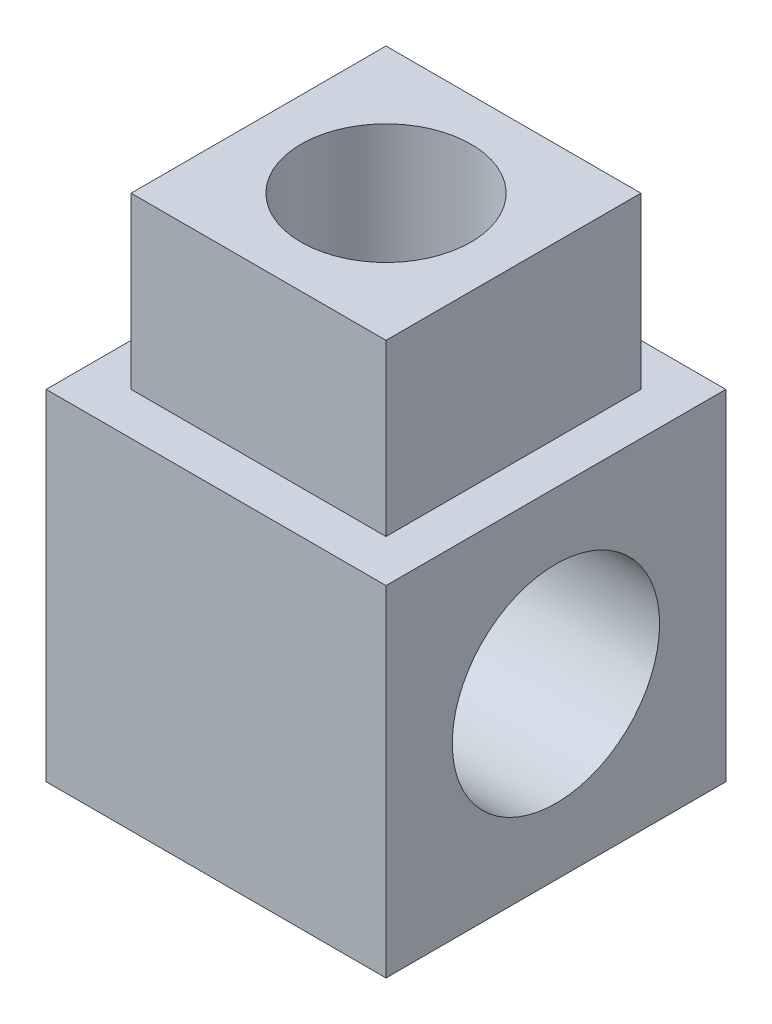
ISO-10303-21;
HEADER;
FILE_DESCRIPTION(('STEP AP214'),'2;1');
FILE_NAME('part.step','',(''),(''),'','','');
FILE_SCHEMA(('AUTOMOTIVE_DESIGN { 1 0 10303 214 1 1 1 1 }'));
ENDSEC;
DATA;
#1=APPLICATION_CONTEXT('core data for automotive mechanical design processes');
#2=APPLICATION_PROTOCOL_DEFINITION('international standard','automotive_design',2000,#1);
#3=PRODUCT_CONTEXT('',#1,'mechanical');
#4=PRODUCT('Part','Part','',(#3));
#5=PRODUCT_RELATED_PRODUCT_CATEGORY('part','',(#4));
#6=PRODUCT_DEFINITION_FORMATION('','',#4);
#7=PRODUCT_DEFINITION_CONTEXT('part definition',#1,'design');
#8=PRODUCT_DEFINITION('design','',#6,#7);
#9=PRODUCT_DEFINITION_SHAPE('','',#8);
#10=(LENGTH_UNIT() NAMED_UNIT(*) SI_UNIT(.MILLI.,.METRE.));
#11=(NAMED_UNIT(*) PLANE_ANGLE_UNIT() SI_UNIT($,.RADIAN.));
#12=(NAMED_UNIT(*) SI_UNIT($,.STERADIAN.) SOLID_ANGLE_UNIT());
#13=UNCERTAINTY_MEASURE_WITH_UNIT(LENGTH_MEASURE(1.E-05),#10,'distance_accuracy_value','');
#14=(GEOMETRIC_REPRESENTATION_CONTEXT(3) GLOBAL_UNCERTAINTY_ASSIGNED_CONTEXT((#13)) GLOBAL_UNIT_ASSIGNED_CONTEXT((#10,
#11,#12)) REPRESENTATION_CONTEXT('',''));
#15=CARTESIAN_POINT('',(0.,0.,0.));
#16=DIRECTION('',(0.,0.,1.));
#17=DIRECTION('',(1.,0.,0.));
#18=AXIS2_PLACEMENT_3D('',#15,#16,#17);
#19=CARTESIAN_POINT('',(10.,10.,10.));
#20=DIRECTION('',(0.,-1.,0.));
#21=DIRECTION('',(0.,0.,-1.));
#22=AXIS2_PLACEMENT_3D('',#19,#20,#21);
#23=PLANE('',#22);
#24=DIRECTION('',(0.,0.,1.));
#25=VECTOR('',#24,1.);
#26=CARTESIAN_POINT('',(-10.,10.,10.));
#27=LINE('',#26,#25);
#28=CARTESIAN_POINT('',(-10.,10.,-10.));
#29=VERTEX_POINT('',#28);
#30=CARTESIAN_POINT('',(-10.,10.,10.));
#31=VERTEX_POINT('',#30);
#32=EDGE_CURVE('E156',#29,#31,#27,.T.);
#33=ORIENTED_EDGE('',*,*,#32,.T.);
#34=DIRECTION('',(-1.,0.,0.));
#35=VECTOR('',#34,1.);
#36=CARTESIAN_POINT('',(10.,10.,10.));
#37=LINE('',#36,#35);
#38=CARTESIAN_POINT('',(10.,10.,10.));
#39=VERTEX_POINT('',#38);
#40=EDGE_CURVE('E53',#39,#31,#37,.T.);
#41=ORIENTED_EDGE('',*,*,#40,.F.);
#42=DIRECTION('',(0.,0.,1.));
#43=VECTOR('',#42,1.);
#44=CARTESIAN_POINT('',(10.,10.,10.));
#45=LINE('',#44,#43);
#46=CARTESIAN_POINT('',(10.,10.,-10.));
#47=VERTEX_POINT('',#46);
#48=EDGE_CURVE('E146',#47,#39,#45,.T.);
#49=ORIENTED_EDGE('',*,*,#48,.F.);
#50=DIRECTION('',(-1.,0.,0.));
#51=VECTOR('',#50,1.);
#52=CARTESIAN_POINT('',(10.,10.,-10.));
#53=LINE('',#52,#51);
#54=EDGE_CURVE('E13',#47,#29,#53,.T.);
#55=ORIENTED_EDGE('',*,*,#54,.T.);
#56=EDGE_LOOP('',(#33,#41,#49,#55));
#57=FACE_BOUND('',#56,.T.);
#58=DIRECTION('',(0.,0.,-1.));
#59=VECTOR('',#58,1.);
#60=CARTESIAN_POINT('',(7.5,10.,-7.5));
#61=LINE('',#60,#59);
#62=CARTESIAN_POINT('',(7.5,10.,7.5));
#63=VERTEX_POINT('',#62);
#64=CARTESIAN_POINT('',(7.5,10.,-7.5));
#65=VERTEX_POINT('',#64);
#66=EDGE_CURVE('E130',#63,#65,#61,.T.);
#67=ORIENTED_EDGE('',*,*,#66,.F.);
#68=DIRECTION('',(1.,0.,0.));
#69=VECTOR('',#68,1.);
#70=CARTESIAN_POINT('',(-7.5,10.,7.5));
#71=LINE('',#70,#69);
#72=CARTESIAN_POINT('',(-7.49999999999999,10.,7.5));
#73=VERTEX_POINT('',#72);
#74=EDGE_CURVE('E127',#73,#63,#71,.T.);
#75=ORIENTED_EDGE('',*,*,#74,.F.);
#76=DIRECTION('',(0.,0.,1.));
#77=VECTOR('',#76,1.);
#78=CARTESIAN_POINT('',(-7.5,10.,-7.5));
#79=LINE('',#78,#77);
#80=CARTESIAN_POINT('',(-7.5,10.,-7.5));
#81=VERTEX_POINT('',#80);
#82=EDGE_CURVE('E65',#81,#73,#79,.T.);
#83=ORIENTED_EDGE('',*,*,#82,.F.);
#84=DIRECTION('',(-1.,0.,0.));
#85=VECTOR('',#84,1.);
#86=CARTESIAN_POINT('',(-7.5,10.,-7.5));
#87=LINE('',#86,#85);
#88=EDGE_CURVE('E60',#65,#81,#87,.T.);
#89=ORIENTED_EDGE('',*,*,#88,.F.);
#90=EDGE_LOOP('',(#67,#75,#83,#89));
#91=FACE_BOUND('',#90,.T.);
#92=ADVANCED_FACE('F45',(#57,#91),#23,.F.);
#93=CARTESIAN_POINT('',(10.,0.,0.));
#94=DIRECTION('',(1.,0.,0.));
#95=DIRECTION('',(0.,0.,-1.));
#96=AXIS2_PLACEMENT_3D('',#93,#94,#95);
#97=PLANE('',#96);
#98=DIRECTION('',(0.,1.,0.));
#99=VECTOR('',#98,1.);
#100=CARTESIAN_POINT('',(10.,10.,-10.));
#101=LINE('',#100,#99);
#102=CARTESIAN_POINT('',(10.,-10.,-10.));
#103=VERTEX_POINT('',#102);
#104=EDGE_CURVE('E143',#103,#47,#101,.T.);
#105=ORIENTED_EDGE('',*,*,#104,.T.);
#106=ORIENTED_EDGE('',*,*,#48,.T.);
#107=DIRECTION('',(0.,-1.,0.));
#108=VECTOR('',#107,1.);
#109=CARTESIAN_POINT('',(10.,10.,10.));
#110=LINE('',#109,#108);
#111=CARTESIAN_POINT('',(10.,-10.,10.));
#112=VERTEX_POINT('',#111);
#113=EDGE_CURVE('E149',#39,#112,#110,.T.);
#114=ORIENTED_EDGE('',*,*,#113,.T.);
#115=DIRECTION('',(0.,0.,-1.));
#116=VECTOR('',#115,1.);
#117=CARTESIAN_POINT('',(10.,-10.,10.));
#118=LINE('',#117,#116);
#119=EDGE_CURVE('E151',#112,#103,#118,.T.);
#120=ORIENTED_EDGE('',*,*,#119,.T.);
#121=EDGE_LOOP('',(#105,#106,#114,#120));
#122=FACE_BOUND('',#121,.T.);
#123=CARTESIAN_POINT('',(10.,0.,0.));
#124=DIRECTION('',(1.,0.,0.));
#125=DIRECTION('',(0.,0.,-1.));
#126=AXIS2_PLACEMENT_3D('',#123,#124,#125);
#127=CIRCLE('',#126,6.1);
#128=CARTESIAN_POINT('',(10.,0.,-6.1));
#129=VERTEX_POINT('',#128);
#130=EDGE_CURVE('E134',#129,#129,#127,.T.);
#131=ORIENTED_EDGE('',*,*,#130,.F.);
#132=EDGE_LOOP('',(#131));
#133=FACE_BOUND('',#132,.T.);
#134=ADVANCED_FACE('F186',(#122,#133),#97,.T.);
#135=CARTESIAN_POINT('',(-10.,0.,0.));
#136=DIRECTION('',(1.,0.,0.));
#137=DIRECTION('',(0.,0.,-1.));
#138=AXIS2_PLACEMENT_3D('',#135,#136,#137);
#139=PLANE('',#138);
#140=DIRECTION('',(0.,1.,0.));
#141=VECTOR('',#140,1.);
#142=CARTESIAN_POINT('',(-10.,10.,-10.));
#143=LINE('',#142,#141);
#144=CARTESIAN_POINT('',(-10.,-10.,-10.));
#145=VERTEX_POINT('',#144);
#146=EDGE_CURVE('E141',#145,#29,#143,.T.);
#147=ORIENTED_EDGE('',*,*,#146,.F.);
#148=DIRECTION('',(0.,0.,-1.));
#149=VECTOR('',#148,1.);
#150=CARTESIAN_POINT('',(-10.,-10.,10.));
#151=LINE('',#150,#149);
#152=CARTESIAN_POINT('',(-10.,-10.,10.));
#153=VERTEX_POINT('',#152);
#154=EDGE_CURVE('E147',#153,#145,#151,.T.);
#155=ORIENTED_EDGE('',*,*,#154,.F.);
#156=DIRECTION('',(0.,-1.,0.));
#157=VECTOR('',#156,1.);
#158=CARTESIAN_POINT('',(-10.,10.,10.));
#159=LINE('',#158,#157);
#160=EDGE_CURVE('E158',#31,#153,#159,.T.);
#161=ORIENTED_EDGE('',*,*,#160,.F.);
#162=ORIENTED_EDGE('',*,*,#32,.F.);
#163=EDGE_LOOP('',(#147,#155,#161,#162));
#164=FACE_BOUND('',#163,.T.);
#165=CARTESIAN_POINT('',(-10.,0.,0.));
#166=DIRECTION('',(1.,0.,0.));
#167=DIRECTION('',(0.,0.,-1.));
#168=AXIS2_PLACEMENT_3D('',#165,#166,#167);
#169=CIRCLE('',#168,6.1);
#170=CARTESIAN_POINT('',(-10.,0.,-6.1));
#171=VERTEX_POINT('',#170);
#172=EDGE_CURVE('E131',#171,#171,#169,.T.);
#173=ORIENTED_EDGE('',*,*,#172,.T.);
#174=EDGE_LOOP('',(#173));
#175=FACE_BOUND('',#174,.T.);
#176=ADVANCED_FACE('F176',(#164,#175),#139,.F.);
#177=CARTESIAN_POINT('',(10.,10.,-10.));
#178=DIRECTION('',(0.,0.,1.));
#179=DIRECTION('',(0.,-1.,0.));
#180=AXIS2_PLACEMENT_3D('',#177,#178,#179);
#181=PLANE('',#180);
#182=ORIENTED_EDGE('',*,*,#146,.T.);
#183=ORIENTED_EDGE('',*,*,#54,.F.);
#184=ORIENTED_EDGE('',*,*,#104,.F.);
#185=DIRECTION('',(-1.,0.,0.));
#186=VECTOR('',#185,1.);
#187=CARTESIAN_POINT('',(10.,-10.,-10.));
#188=LINE('',#187,#186);
#189=EDGE_CURVE('E153',#103,#145,#188,.T.);
#190=ORIENTED_EDGE('',*,*,#189,.T.);
#191=EDGE_LOOP('',(#182,#183,#184,#190));
#192=FACE_BOUND('',#191,.T.);
#193=ADVANCED_FACE('F47',(#192),#181,.F.);
#194=CARTESIAN_POINT('',(10.,10.,10.));
#195=DIRECTION('',(0.,0.,-1.));
#196=DIRECTION('',(0.,1.,0.));
#197=AXIS2_PLACEMENT_3D('',#194,#195,#196);
#198=PLANE('',#197);
#199=ORIENTED_EDGE('',*,*,#160,.T.);
#200=DIRECTION('',(-1.,0.,0.));
#201=VECTOR('',#200,1.);
#202=CARTESIAN_POINT('',(10.,-10.,10.));
#203=LINE('',#202,#201);
#204=EDGE_CURVE('E163',#112,#153,#203,.T.);
#205=ORIENTED_EDGE('',*,*,#204,.F.);
#206=ORIENTED_EDGE('',*,*,#113,.F.);
#207=ORIENTED_EDGE('',*,*,#40,.T.);
#208=EDGE_LOOP('',(#199,#205,#206,#207));
#209=FACE_BOUND('',#208,.T.);
#210=ADVANCED_FACE('F170',(#209),#198,.F.);
#211=CARTESIAN_POINT('',(10.,-10.,10.));
#212=DIRECTION('',(0.,1.,0.));
#213=DIRECTION('',(0.,0.,1.));
#214=AXIS2_PLACEMENT_3D('',#211,#212,#213);
#215=PLANE('',#214);
#216=ORIENTED_EDGE('',*,*,#154,.T.);
#217=ORIENTED_EDGE('',*,*,#189,.F.);
#218=ORIENTED_EDGE('',*,*,#119,.F.);
#219=ORIENTED_EDGE('',*,*,#204,.T.);
#220=EDGE_LOOP('',(#216,#217,#218,#219));
#221=FACE_BOUND('',#220,.T.);
#222=ADVANCED_FACE('F180',(#221),#215,.F.);
#223=CARTESIAN_POINT('',(10.,0.,0.));
#224=DIRECTION('',(-1.,0.,0.));
#225=DIRECTION('',(0.,0.,1.));
#226=AXIS2_PLACEMENT_3D('',#223,#224,#225);
#227=CYLINDRICAL_SURFACE('',#226,6.1);
#228=ORIENTED_EDGE('',*,*,#130,.T.);
#229=EDGE_LOOP('',(#228));
#230=FACE_BOUND('',#229,.T.);
#231=ORIENTED_EDGE('',*,*,#172,.F.);
#232=EDGE_LOOP('',(#231));
#233=FACE_BOUND('',#232,.T.);
#234=ADVANCED_FACE('F234',(#230,#233),#227,.F.);
#235=CARTESIAN_POINT('',(7.5,20.,-7.5));
#236=DIRECTION('',(-1.,0.,0.));
#237=DIRECTION('',(0.,0.,1.));
#238=AXIS2_PLACEMENT_3D('',#235,#236,#237);
#239=PLANE('',#238);
#240=ORIENTED_EDGE('',*,*,#66,.T.);
#241=DIRECTION('',(0.,-1.,0.));
#242=VECTOR('',#241,1.);
#243=CARTESIAN_POINT('',(7.5,20.,-7.5));
#244=LINE('',#243,#242);
#245=CARTESIAN_POINT('',(7.5,20.,-7.5));
#246=VERTEX_POINT('',#245);
#247=EDGE_CURVE('E111',#246,#65,#244,.T.);
#248=ORIENTED_EDGE('',*,*,#247,.F.);
#249=DIRECTION('',(0.,0.,-1.));
#250=VECTOR('',#249,1.);
#251=CARTESIAN_POINT('',(7.5,20.,-7.5));
#252=LINE('',#251,#250);
#253=CARTESIAN_POINT('',(7.5,20.,7.5));
#254=VERTEX_POINT('',#253);
#255=EDGE_CURVE('E118',#254,#246,#252,.T.);
#256=ORIENTED_EDGE('',*,*,#255,.F.);
#257=DIRECTION('',(0.,-1.,0.));
#258=VECTOR('',#257,1.);
#259=CARTESIAN_POINT('',(7.5,20.,7.5));
#260=LINE('',#259,#258);
#261=EDGE_CURVE('E195',#254,#63,#260,.T.);
#262=ORIENTED_EDGE('',*,*,#261,.T.);
#263=EDGE_LOOP('',(#240,#248,#256,#262));
#264=FACE_BOUND('',#263,.T.);
#265=ADVANCED_FACE('F129',(#264),#239,.F.);
#266=CARTESIAN_POINT('',(-7.5,20.,-7.5));
#267=DIRECTION('',(0.,0.,1.));
#268=DIRECTION('',(1.,0.,0.));
#269=AXIS2_PLACEMENT_3D('',#266,#267,#268);
#270=PLANE('',#269);
#271=ORIENTED_EDGE('',*,*,#88,.T.);
#272=DIRECTION('',(0.,-1.,0.));
#273=VECTOR('',#272,1.);
#274=CARTESIAN_POINT('',(-7.5,20.,-7.5));
#275=LINE('',#274,#273);
#276=CARTESIAN_POINT('',(-7.5,20.,-7.5));
#277=VERTEX_POINT('',#276);
#278=EDGE_CURVE('E114',#277,#81,#275,.T.);
#279=ORIENTED_EDGE('',*,*,#278,.F.);
#280=DIRECTION('',(-1.,0.,0.));
#281=VECTOR('',#280,1.);
#282=CARTESIAN_POINT('',(-7.5,20.,-7.5));
#283=LINE('',#282,#281);
#284=EDGE_CURVE('E107',#246,#277,#283,.T.);
#285=ORIENTED_EDGE('',*,*,#284,.F.);
#286=ORIENTED_EDGE('',*,*,#247,.T.);
#287=EDGE_LOOP('',(#271,#279,#285,#286));
#288=FACE_BOUND('',#287,.T.);
#289=ADVANCED_FACE('F109',(#288),#270,.F.);
#290=CARTESIAN_POINT('',(-7.5,20.,-7.5));
#291=DIRECTION('',(1.,0.,0.));
#292=DIRECTION('',(0.,0.,-1.));
#293=AXIS2_PLACEMENT_3D('',#290,#291,#292);
#294=PLANE('',#293);
#295=ORIENTED_EDGE('',*,*,#82,.T.);
#296=DIRECTION('',(0.,-1.,0.));
#297=VECTOR('',#296,1.);
#298=CARTESIAN_POINT('',(-7.5,20.,7.5));
#299=LINE('',#298,#297);
#300=CARTESIAN_POINT('',(-7.5,20.,7.5));
#301=VERTEX_POINT('',#300);
#302=EDGE_CURVE('E136',#301,#73,#299,.T.);
#303=ORIENTED_EDGE('',*,*,#302,.F.);
#304=DIRECTION('',(0.,0.,1.));
#305=VECTOR('',#304,1.);
#306=CARTESIAN_POINT('',(-7.5,20.,-7.5));
#307=LINE('',#306,#305);
#308=EDGE_CURVE('E117',#277,#301,#307,.T.);
#309=ORIENTED_EDGE('',*,*,#308,.F.);
#310=ORIENTED_EDGE('',*,*,#278,.T.);
#311=EDGE_LOOP('',(#295,#303,#309,#310));
#312=FACE_BOUND('',#311,.T.);
#313=ADVANCED_FACE('F223',(#312),#294,.F.);
#314=CARTESIAN_POINT('',(-7.5,20.,7.5));
#315=DIRECTION('',(0.,0.,-1.));
#316=DIRECTION('',(-1.,0.,0.));
#317=AXIS2_PLACEMENT_3D('',#314,#315,#316);
#318=PLANE('',#317);
#319=ORIENTED_EDGE('',*,*,#74,.T.);
#320=ORIENTED_EDGE('',*,*,#261,.F.);
#321=DIRECTION('',(1.,0.,0.));
#322=VECTOR('',#321,1.);
#323=CARTESIAN_POINT('',(-7.5,20.,7.5));
#324=LINE('',#323,#322);
#325=EDGE_CURVE('E123',#301,#254,#324,.T.);
#326=ORIENTED_EDGE('',*,*,#325,.F.);
#327=ORIENTED_EDGE('',*,*,#302,.T.);
#328=EDGE_LOOP('',(#319,#320,#326,#327));
#329=FACE_BOUND('',#328,.T.);
#330=ADVANCED_FACE('F194',(#329),#318,.F.);
#331=CARTESIAN_POINT('',(0.,20.,0.));
#332=DIRECTION('',(0.,1.,0.));
#333=DIRECTION('',(0.,0.,1.));
#334=AXIS2_PLACEMENT_3D('',#331,#332,#333);
#335=PLANE('',#334);
#336=CARTESIAN_POINT('',(0.,20.,0.));
#337=DIRECTION('',(0.,1.,0.));
#338=DIRECTION('',(0.,0.,1.));
#339=AXIS2_PLACEMENT_3D('',#336,#337,#338);
#340=CIRCLE('',#339,5.);
#341=CARTESIAN_POINT('',(0.,20.,5.));
#342=VERTEX_POINT('',#341);
#343=EDGE_CURVE('E204',#342,#342,#340,.T.);
#344=ORIENTED_EDGE('',*,*,#343,.F.);
#345=EDGE_LOOP('',(#344));
#346=FACE_BOUND('',#345,.T.);
#347=ORIENTED_EDGE('',*,*,#255,.T.);
#348=ORIENTED_EDGE('',*,*,#284,.T.);
#349=ORIENTED_EDGE('',*,*,#308,.T.);
#350=ORIENTED_EDGE('',*,*,#325,.T.);
#351=EDGE_LOOP('',(#347,#348,#349,#350));
#352=FACE_BOUND('',#351,.T.);
#353=ADVANCED_FACE('F121',(#346,#352),#335,.T.);
#354=CARTESIAN_POINT('',(0.,10.,0.));
#355=DIRECTION('',(0.,1.,0.));
#356=DIRECTION('',(0.,0.,1.));
#357=AXIS2_PLACEMENT_3D('',#354,#355,#356);
#358=CYLINDRICAL_SURFACE('',#357,5.);
#359=CARTESIAN_POINT('',(0.,10.,0.));
#360=DIRECTION('',(0.,1.,0.));
#361=DIRECTION('',(0.,0.,1.));
#362=AXIS2_PLACEMENT_3D('',#359,#360,#361);
#363=CIRCLE('',#362,5.);
#364=CARTESIAN_POINT('',(0.,10.,5.));
#365=VERTEX_POINT('',#364);
#366=EDGE_CURVE('E190',#365,#365,#363,.T.);
#367=ORIENTED_EDGE('',*,*,#366,.F.);
#368=EDGE_LOOP('',(#367));
#369=FACE_BOUND('',#368,.T.);
#370=ORIENTED_EDGE('',*,*,#343,.T.);
#371=EDGE_LOOP('',(#370));
#372=FACE_BOUND('',#371,.T.);
#373=ADVANCED_FACE('F212',(#369,#372),#358,.F.);
#374=CARTESIAN_POINT('',(0.,10.,0.));
#375=DIRECTION('',(0.,1.,0.));
#376=DIRECTION('',(0.,0.,1.));
#377=AXIS2_PLACEMENT_3D('',#374,#375,#376);
#378=PLANE('',#377);
#379=ORIENTED_EDGE('',*,*,#366,.T.);
#380=EDGE_LOOP('',(#379));
#381=FACE_BOUND('',#380,.T.);
#382=ADVANCED_FACE('F210',(#381),#378,.T.);
#383=CLOSED_SHELL('',(#92,#134,#176,#193,#210,#222,#234,#265,#289,#313,#330,#353,#373,#382));
#384=MANIFOLD_SOLID_BREP('B2',#383);
#385=ADVANCED_BREP_SHAPE_REPRESENTATION('',(#18,#384),#14);
#386=SHAPE_DEFINITION_REPRESENTATION(#9,#385);
ENDSEC;
END-ISO-10303-21;
